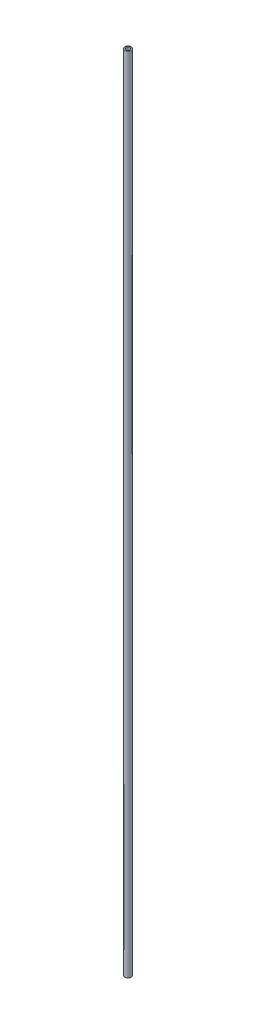
ISO-10303-21;
HEADER;
FILE_DESCRIPTION(('STEP AP214'),'2;1');
FILE_NAME('part.step','',(''),(''),'','','');
FILE_SCHEMA(('AUTOMOTIVE_DESIGN { 1 0 10303 214 1 1 1 1 }'));
ENDSEC;
DATA;
#1=APPLICATION_CONTEXT('core data for automotive mechanical design processes');
#2=APPLICATION_PROTOCOL_DEFINITION('international standard','automotive_design',2000,#1);
#3=PRODUCT_CONTEXT('',#1,'mechanical');
#4=PRODUCT('Part','Part','',(#3));
#5=PRODUCT_RELATED_PRODUCT_CATEGORY('part','',(#4));
#6=PRODUCT_DEFINITION_FORMATION('','',#4);
#7=PRODUCT_DEFINITION_CONTEXT('part definition',#1,'design');
#8=PRODUCT_DEFINITION('design','',#6,#7);
#9=PRODUCT_DEFINITION_SHAPE('','',#8);
#10=(LENGTH_UNIT() NAMED_UNIT(*) SI_UNIT(.MILLI.,.METRE.));
#11=(NAMED_UNIT(*) PLANE_ANGLE_UNIT() SI_UNIT($,.RADIAN.));
#12=(NAMED_UNIT(*) SI_UNIT($,.STERADIAN.) SOLID_ANGLE_UNIT());
#13=UNCERTAINTY_MEASURE_WITH_UNIT(LENGTH_MEASURE(1.E-05),#10,'distance_accuracy_value','');
#14=(GEOMETRIC_REPRESENTATION_CONTEXT(3) GLOBAL_UNCERTAINTY_ASSIGNED_CONTEXT((#13)) GLOBAL_UNIT_ASSIGNED_CONTEXT((#10,
#11,#12)) REPRESENTATION_CONTEXT('',''));
#15=CARTESIAN_POINT('',(0.,0.,0.));
#16=DIRECTION('',(0.,0.,1.));
#17=DIRECTION('',(1.,0.,0.));
#18=AXIS2_PLACEMENT_3D('',#15,#16,#17);
#19=CARTESIAN_POINT('',(0.,-200.,0.));
#20=DIRECTION('',(0.,1.,0.));
#21=DIRECTION('',(0.,0.,1.));
#22=AXIS2_PLACEMENT_3D('',#19,#20,#21);
#23=CYLINDRICAL_SURFACE('',#22,9.);
#24=CARTESIAN_POINT('',(0.,-200.,0.));
#25=DIRECTION('',(0.,1.,0.));
#26=DIRECTION('',(0.,0.,1.));
#27=AXIS2_PLACEMENT_3D('',#24,#25,#26);
#28=CIRCLE('',#27,9.);
#29=CARTESIAN_POINT('',(0.,-200.,9.));
#30=VERTEX_POINT('',#29);
#31=EDGE_CURVE('E10',#30,#30,#28,.T.);
#32=ORIENTED_EDGE('',*,*,#31,.T.);
#33=EDGE_LOOP('',(#32));
#34=FACE_BOUND('',#33,.T.);
#35=CARTESIAN_POINT('',(0.,2100.,0.));
#36=DIRECTION('',(0.,1.,0.));
#37=DIRECTION('',(0.,0.,1.));
#38=AXIS2_PLACEMENT_3D('',#35,#36,#37);
#39=CIRCLE('',#38,9.);
#40=CARTESIAN_POINT('',(0.,2100.,9.));
#41=VERTEX_POINT('',#40);
#42=EDGE_CURVE('E40',#41,#41,#39,.T.);
#43=ORIENTED_EDGE('',*,*,#42,.F.);
#44=EDGE_LOOP('',(#43));
#45=FACE_BOUND('',#44,.T.);
#46=ADVANCED_FACE('F30',(#34,#45),#23,.T.);
#47=CARTESIAN_POINT('',(0.,-200.,0.));
#48=DIRECTION('',(0.,1.,0.));
#49=DIRECTION('',(0.,0.,1.));
#50=AXIS2_PLACEMENT_3D('',#47,#48,#49);
#51=PLANE('',#50);
#52=CARTESIAN_POINT('',(0.,-200.,0.));
#53=DIRECTION('',(0.,1.,0.));
#54=DIRECTION('',(0.,0.,1.));
#55=AXIS2_PLACEMENT_3D('',#52,#53,#54);
#56=CIRCLE('',#55,6.);
#57=CARTESIAN_POINT('',(0.,-200.,6.));
#58=VERTEX_POINT('',#57);
#59=EDGE_CURVE('E36',#58,#58,#56,.T.);
#60=ORIENTED_EDGE('',*,*,#59,.T.);
#61=EDGE_LOOP('',(#60));
#62=FACE_BOUND('',#61,.T.);
#63=ORIENTED_EDGE('',*,*,#31,.F.);
#64=EDGE_LOOP('',(#63));
#65=FACE_BOUND('',#64,.T.);
#66=ADVANCED_FACE('F59',(#62,#65),#51,.F.);
#67=CARTESIAN_POINT('',(0.,-200.,0.));
#68=DIRECTION('',(0.,1.,0.));
#69=DIRECTION('',(0.,0.,1.));
#70=AXIS2_PLACEMENT_3D('',#67,#68,#69);
#71=CYLINDRICAL_SURFACE('',#70,6.);
#72=ORIENTED_EDGE('',*,*,#59,.F.);
#73=EDGE_LOOP('',(#72));
#74=FACE_BOUND('',#73,.T.);
#75=CARTESIAN_POINT('',(0.,2100.,0.));
#76=DIRECTION('',(0.,1.,0.));
#77=DIRECTION('',(0.,0.,1.));
#78=AXIS2_PLACEMENT_3D('',#75,#76,#77);
#79=CIRCLE('',#78,6.);
#80=CARTESIAN_POINT('',(0.,2100.,6.));
#81=VERTEX_POINT('',#80);
#82=EDGE_CURVE('E44',#81,#81,#79,.T.);
#83=ORIENTED_EDGE('',*,*,#82,.T.);
#84=EDGE_LOOP('',(#83));
#85=FACE_BOUND('',#84,.T.);
#86=ADVANCED_FACE('F50',(#74,#85),#71,.F.);
#87=CARTESIAN_POINT('',(0.,2100.,0.));
#88=DIRECTION('',(0.,1.,0.));
#89=DIRECTION('',(0.,0.,1.));
#90=AXIS2_PLACEMENT_3D('',#87,#88,#89);
#91=PLANE('',#90);
#92=ORIENTED_EDGE('',*,*,#42,.T.);
#93=EDGE_LOOP('',(#92));
#94=FACE_BOUND('',#93,.T.);
#95=ORIENTED_EDGE('',*,*,#82,.F.);
#96=EDGE_LOOP('',(#95));
#97=FACE_BOUND('',#96,.T.);
#98=ADVANCED_FACE('F52',(#94,#97),#91,.T.);
#99=CLOSED_SHELL('',(#46,#66,#86,#98));
#100=MANIFOLD_SOLID_BREP('B2',#99);
#101=ADVANCED_BREP_SHAPE_REPRESENTATION('',(#18,#100),#14);
#102=SHAPE_DEFINITION_REPRESENTATION(#9,#101);
ENDSEC;
END-ISO-10303-21;
